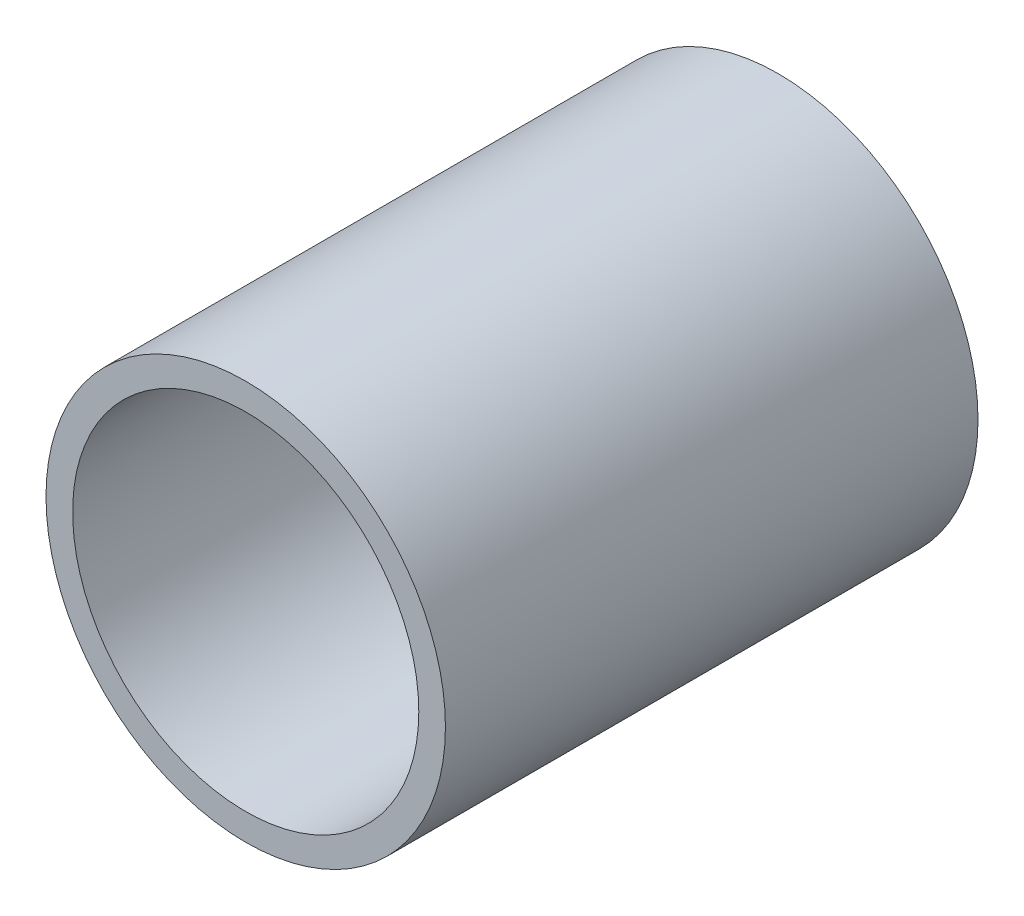
ISO-10303-21;
HEADER;
FILE_DESCRIPTION(('STEP AP214'),'2;1');
FILE_NAME('part.step','',(''),(''),'','','');
FILE_SCHEMA(('AUTOMOTIVE_DESIGN { 1 0 10303 214 1 1 1 1 }'));
ENDSEC;
DATA;
#1=APPLICATION_CONTEXT('core data for automotive mechanical design processes');
#2=APPLICATION_PROTOCOL_DEFINITION('international standard','automotive_design',2000,#1);
#3=PRODUCT_CONTEXT('',#1,'mechanical');
#4=PRODUCT('Part','Part','',(#3));
#5=PRODUCT_RELATED_PRODUCT_CATEGORY('part','',(#4));
#6=PRODUCT_DEFINITION_FORMATION('','',#4);
#7=PRODUCT_DEFINITION_CONTEXT('part definition',#1,'design');
#8=PRODUCT_DEFINITION('design','',#6,#7);
#9=PRODUCT_DEFINITION_SHAPE('','',#8);
#10=(LENGTH_UNIT() NAMED_UNIT(*) SI_UNIT(.MILLI.,.METRE.));
#11=(NAMED_UNIT(*) PLANE_ANGLE_UNIT() SI_UNIT($,.RADIAN.));
#12=(NAMED_UNIT(*) SI_UNIT($,.STERADIAN.) SOLID_ANGLE_UNIT());
#13=UNCERTAINTY_MEASURE_WITH_UNIT(LENGTH_MEASURE(1.E-05),#10,'distance_accuracy_value','');
#14=(GEOMETRIC_REPRESENTATION_CONTEXT(3) GLOBAL_UNCERTAINTY_ASSIGNED_CONTEXT((#13)) GLOBAL_UNIT_ASSIGNED_CONTEXT((#10,
#11,#12)) REPRESENTATION_CONTEXT('',''));
#15=CARTESIAN_POINT('',(0.,0.,0.));
#16=DIRECTION('',(0.,0.,1.));
#17=DIRECTION('',(1.,0.,0.));
#18=AXIS2_PLACEMENT_3D('',#15,#16,#17);
#19=CARTESIAN_POINT('',(0.,0.,40.));
#20=DIRECTION('',(0.,0.,-1.));
#21=DIRECTION('',(-1.,0.,0.));
#22=AXIS2_PLACEMENT_3D('',#19,#20,#21);
#23=CYLINDRICAL_SURFACE('',#22,15.);
#24=CARTESIAN_POINT('',(0.,0.,40.));
#25=DIRECTION('',(0.,0.,1.));
#26=DIRECTION('',(1.,0.,0.));
#27=AXIS2_PLACEMENT_3D('',#24,#25,#26);
#28=CIRCLE('',#27,15.);
#29=CARTESIAN_POINT('',(15.,0.,40.));
#30=VERTEX_POINT('',#29);
#31=EDGE_CURVE('E10',#30,#30,#28,.T.);
#32=ORIENTED_EDGE('',*,*,#31,.F.);
#33=EDGE_LOOP('',(#32));
#34=FACE_BOUND('',#33,.T.);
#35=CARTESIAN_POINT('',(0.,0.,0.));
#36=DIRECTION('',(0.,0.,1.));
#37=DIRECTION('',(1.,0.,0.));
#38=AXIS2_PLACEMENT_3D('',#35,#36,#37);
#39=CIRCLE('',#38,15.);
#40=CARTESIAN_POINT('',(15.,0.,0.));
#41=VERTEX_POINT('',#40);
#42=EDGE_CURVE('E46',#41,#41,#39,.T.);
#43=ORIENTED_EDGE('',*,*,#42,.T.);
#44=EDGE_LOOP('',(#43));
#45=FACE_BOUND('',#44,.T.);
#46=ADVANCED_FACE('F43',(#34,#45),#23,.T.);
#47=CARTESIAN_POINT('',(0.,0.,40.));
#48=DIRECTION('',(0.,0.,1.));
#49=DIRECTION('',(1.,0.,0.));
#50=AXIS2_PLACEMENT_3D('',#47,#48,#49);
#51=PLANE('',#50);
#52=CARTESIAN_POINT('',(0.,0.,40.));
#53=DIRECTION('',(0.,0.,1.));
#54=DIRECTION('',(1.,0.,0.));
#55=AXIS2_PLACEMENT_3D('',#52,#53,#54);
#56=CIRCLE('',#55,13.);
#57=CARTESIAN_POINT('',(13.,0.,40.));
#58=VERTEX_POINT('',#57);
#59=EDGE_CURVE('E55',#58,#58,#56,.T.);
#60=ORIENTED_EDGE('',*,*,#59,.F.);
#61=EDGE_LOOP('',(#60));
#62=FACE_BOUND('',#61,.T.);
#63=ORIENTED_EDGE('',*,*,#31,.T.);
#64=EDGE_LOOP('',(#63));
#65=FACE_BOUND('',#64,.T.);
#66=ADVANCED_FACE('F78',(#62,#65),#51,.T.);
#67=CARTESIAN_POINT('',(0.,0.,0.));
#68=DIRECTION('',(0.,0.,1.));
#69=DIRECTION('',(1.,0.,0.));
#70=AXIS2_PLACEMENT_3D('',#67,#68,#69);
#71=PLANE('',#70);
#72=ORIENTED_EDGE('',*,*,#42,.F.);
#73=EDGE_LOOP('',(#72));
#74=FACE_BOUND('',#73,.T.);
#75=ADVANCED_FACE('F69',(#74),#71,.F.);
#76=CARTESIAN_POINT('',(0.,0.,40.));
#77=DIRECTION('',(0.,0.,-1.));
#78=DIRECTION('',(-1.,0.,0.));
#79=AXIS2_PLACEMENT_3D('',#76,#77,#78);
#80=CYLINDRICAL_SURFACE('',#79,13.);
#81=ORIENTED_EDGE('',*,*,#59,.T.);
#82=EDGE_LOOP('',(#81));
#83=FACE_BOUND('',#82,.T.);
#84=CARTESIAN_POINT('',(0.,0.,2.));
#85=DIRECTION('',(0.,0.,1.));
#86=DIRECTION('',(1.,0.,0.));
#87=AXIS2_PLACEMENT_3D('',#84,#85,#86);
#88=CIRCLE('',#87,13.);
#89=CARTESIAN_POINT('',(13.,0.,2.));
#90=VERTEX_POINT('',#89);
#91=EDGE_CURVE('E60',#90,#90,#88,.T.);
#92=ORIENTED_EDGE('',*,*,#91,.F.);
#93=EDGE_LOOP('',(#92));
#94=FACE_BOUND('',#93,.T.);
#95=ADVANCED_FACE('F67',(#83,#94),#80,.F.);
#96=CARTESIAN_POINT('',(0.,0.,2.));
#97=DIRECTION('',(0.,0.,1.));
#98=DIRECTION('',(1.,0.,0.));
#99=AXIS2_PLACEMENT_3D('',#96,#97,#98);
#100=PLANE('',#99);
#101=ORIENTED_EDGE('',*,*,#91,.T.);
#102=EDGE_LOOP('',(#101));
#103=FACE_BOUND('',#102,.T.);
#104=ADVANCED_FACE('F65',(#103),#100,.T.);
#105=CLOSED_SHELL('',(#46,#66,#75,#95,#104));
#106=MANIFOLD_SOLID_BREP('B2',#105);
#107=ADVANCED_BREP_SHAPE_REPRESENTATION('',(#18,#106),#14);
#108=SHAPE_DEFINITION_REPRESENTATION(#9,#107);
ENDSEC;
END-ISO-10303-21;
